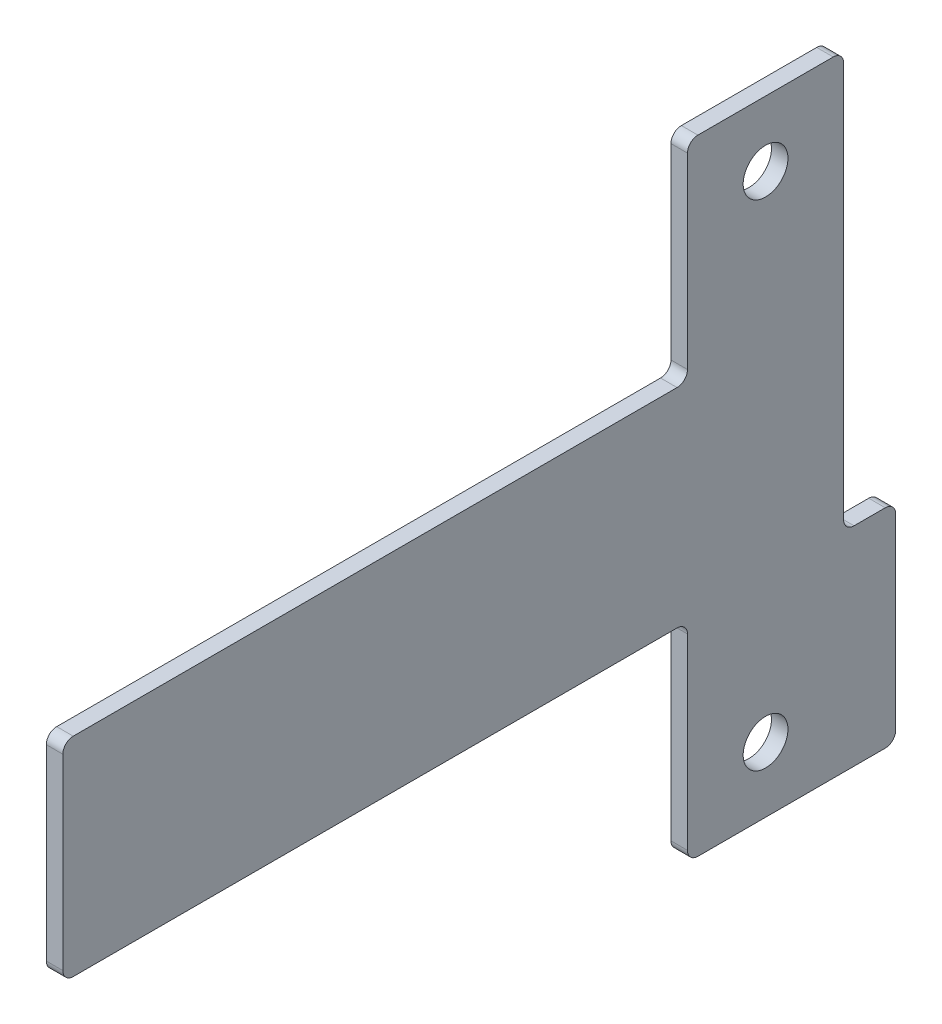
ISO-10303-21;
HEADER;
FILE_DESCRIPTION(('STEP AP214'),'2;1');
FILE_NAME('part.step','',(''),(''),'','','');
FILE_SCHEMA(('AUTOMOTIVE_DESIGN { 1 0 10303 214 1 1 1 1 }'));
ENDSEC;
DATA;
#1=APPLICATION_CONTEXT('core data for automotive mechanical design processes');
#2=APPLICATION_PROTOCOL_DEFINITION('international standard','automotive_design',2000,#1);
#3=PRODUCT_CONTEXT('',#1,'mechanical');
#4=PRODUCT('Part','Part','',(#3));
#5=PRODUCT_RELATED_PRODUCT_CATEGORY('part','',(#4));
#6=PRODUCT_DEFINITION_FORMATION('','',#4);
#7=PRODUCT_DEFINITION_CONTEXT('part definition',#1,'design');
#8=PRODUCT_DEFINITION('design','',#6,#7);
#9=PRODUCT_DEFINITION_SHAPE('','',#8);
#10=(LENGTH_UNIT() NAMED_UNIT(*) SI_UNIT(.MILLI.,.METRE.));
#11=(NAMED_UNIT(*) PLANE_ANGLE_UNIT() SI_UNIT($,.RADIAN.));
#12=(NAMED_UNIT(*) SI_UNIT($,.STERADIAN.) SOLID_ANGLE_UNIT());
#13=UNCERTAINTY_MEASURE_WITH_UNIT(LENGTH_MEASURE(1.E-05),#10,'distance_accuracy_value','');
#14=(GEOMETRIC_REPRESENTATION_CONTEXT(3) GLOBAL_UNCERTAINTY_ASSIGNED_CONTEXT((#13)) GLOBAL_UNIT_ASSIGNED_CONTEXT((#10,
#11,#12)) REPRESENTATION_CONTEXT('',''));
#15=CARTESIAN_POINT('',(0.,0.,0.));
#16=DIRECTION('',(0.,0.,1.));
#17=DIRECTION('',(1.,0.,0.));
#18=AXIS2_PLACEMENT_3D('',#15,#16,#17);
#19=CARTESIAN_POINT('',(1.5875,0.,0.));
#20=DIRECTION('',(-1.,0.,0.));
#21=DIRECTION('',(0.,0.,1.));
#22=AXIS2_PLACEMENT_3D('',#19,#20,#21);
#23=PLANE('',#22);
#24=DIRECTION('',(0.,0.,-1.));
#25=VECTOR('',#24,1.);
#26=CARTESIAN_POINT('',(1.5875,-30.,-7.50000000000001));
#27=LINE('',#26,#25);
#28=CARTESIAN_POINT('',(1.5875,-30.,6.5));
#29=VERTEX_POINT('',#28);
#30=CARTESIAN_POINT('',(1.5875,-30.,-11.5));
#31=VERTEX_POINT('',#30);
#32=EDGE_CURVE('E383',#29,#31,#27,.T.);
#33=ORIENTED_EDGE('',*,*,#32,.T.);
#34=CARTESIAN_POINT('',(1.5875,-29.,-11.5));
#35=DIRECTION('',(-1.,0.,0.));
#36=DIRECTION('',(0.,0.,1.));
#37=AXIS2_PLACEMENT_3D('',#34,#35,#36);
#38=CIRCLE('',#37,1.);
#39=CARTESIAN_POINT('',(1.5875,-29.,-12.5));
#40=VERTEX_POINT('',#39);
#41=EDGE_CURVE('E268',#31,#40,#38,.F.);
#42=ORIENTED_EDGE('',*,*,#41,.T.);
#43=DIRECTION('',(0.,1.,0.));
#44=VECTOR('',#43,1.);
#45=CARTESIAN_POINT('',(1.5875,-10.,-12.5));
#46=LINE('',#45,#44);
#47=CARTESIAN_POINT('',(1.5875,-11.,-12.5));
#48=VERTEX_POINT('',#47);
#49=EDGE_CURVE('E199',#40,#48,#46,.T.);
#50=ORIENTED_EDGE('',*,*,#49,.T.);
#51=CARTESIAN_POINT('',(1.5875,-11.,-11.5));
#52=DIRECTION('',(-1.,0.,0.));
#53=DIRECTION('',(0.,0.,1.));
#54=AXIS2_PLACEMENT_3D('',#51,#52,#53);
#55=CIRCLE('',#54,1.);
#56=CARTESIAN_POINT('',(1.5875,-10.,-11.5));
#57=VERTEX_POINT('',#56);
#58=EDGE_CURVE('E265',#48,#57,#55,.F.);
#59=ORIENTED_EDGE('',*,*,#58,.T.);
#60=DIRECTION('',(0.,0.,1.));
#61=VECTOR('',#60,1.);
#62=CARTESIAN_POINT('',(1.5875,-10.,-7.50000000000001));
#63=LINE('',#62,#61);
#64=CARTESIAN_POINT('',(1.5875,-10.,-8.5));
#65=VERTEX_POINT('',#64);
#66=EDGE_CURVE('E388',#57,#65,#63,.T.);
#67=ORIENTED_EDGE('',*,*,#66,.T.);
#68=CARTESIAN_POINT('',(1.5875,-8.99999999999999,-8.5));
#69=DIRECTION('',(-1.,0.,0.));
#70=DIRECTION('',(0.,0.,1.));
#71=AXIS2_PLACEMENT_3D('',#68,#69,#70);
#72=CIRCLE('',#71,1.);
#73=CARTESIAN_POINT('',(1.5875,-8.99999999999999,-7.50000000000001));
#74=VERTEX_POINT('',#73);
#75=EDGE_CURVE('E329',#65,#74,#72,.T.);
#76=ORIENTED_EDGE('',*,*,#75,.T.);
#77=DIRECTION('',(0.,1.,0.));
#78=VECTOR('',#77,1.);
#79=CARTESIAN_POINT('',(1.5875,30.,-7.50000000000001));
#80=LINE('',#79,#78);
#81=CARTESIAN_POINT('',(1.5875,29.,-7.50000000000001));
#82=VERTEX_POINT('',#81);
#83=EDGE_CURVE('E392',#74,#82,#80,.T.);
#84=ORIENTED_EDGE('',*,*,#83,.T.);
#85=CARTESIAN_POINT('',(1.5875,29.,-6.5));
#86=DIRECTION('',(-1.,0.,0.));
#87=DIRECTION('',(0.,0.,1.));
#88=AXIS2_PLACEMENT_3D('',#85,#86,#87);
#89=CIRCLE('',#88,1.);
#90=CARTESIAN_POINT('',(1.5875,30.,-6.5));
#91=VERTEX_POINT('',#90);
#92=EDGE_CURVE('E62',#82,#91,#89,.F.);
#93=ORIENTED_EDGE('',*,*,#92,.T.);
#94=DIRECTION('',(0.,0.,1.));
#95=VECTOR('',#94,1.);
#96=CARTESIAN_POINT('',(1.5875,30.,7.5));
#97=LINE('',#96,#95);
#98=CARTESIAN_POINT('',(1.5875,30.,6.5));
#99=VERTEX_POINT('',#98);
#100=EDGE_CURVE('E228',#91,#99,#97,.T.);
#101=ORIENTED_EDGE('',*,*,#100,.T.);
#102=CARTESIAN_POINT('',(1.5875,29.,6.5));
#103=DIRECTION('',(-1.,0.,0.));
#104=DIRECTION('',(0.,0.,1.));
#105=AXIS2_PLACEMENT_3D('',#102,#103,#104);
#106=CIRCLE('',#105,1.);
#107=CARTESIAN_POINT('',(1.5875,29.,7.5));
#108=VERTEX_POINT('',#107);
#109=EDGE_CURVE('E251',#99,#108,#106,.F.);
#110=ORIENTED_EDGE('',*,*,#109,.T.);
#111=DIRECTION('',(0.,-1.,0.));
#112=VECTOR('',#111,1.);
#113=CARTESIAN_POINT('',(1.5875,10.,7.5));
#114=LINE('',#113,#112);
#115=CARTESIAN_POINT('',(1.5875,11.,7.5));
#116=VERTEX_POINT('',#115);
#117=EDGE_CURVE('E226',#108,#116,#114,.T.);
#118=ORIENTED_EDGE('',*,*,#117,.T.);
#119=CARTESIAN_POINT('',(1.5875,11.,8.5));
#120=DIRECTION('',(-1.,0.,0.));
#121=DIRECTION('',(0.,0.,1.));
#122=AXIS2_PLACEMENT_3D('',#119,#120,#121);
#123=CIRCLE('',#122,1.);
#124=CARTESIAN_POINT('',(1.5875,10.,8.5));
#125=VERTEX_POINT('',#124);
#126=EDGE_CURVE('E11',#116,#125,#123,.T.);
#127=ORIENTED_EDGE('',*,*,#126,.T.);
#128=DIRECTION('',(0.,0.,1.));
#129=VECTOR('',#128,1.);
#130=CARTESIAN_POINT('',(1.5875,10.,67.5));
#131=LINE('',#130,#129);
#132=CARTESIAN_POINT('',(1.5875,10.,66.5));
#133=VERTEX_POINT('',#132);
#134=EDGE_CURVE('E360',#125,#133,#131,.T.);
#135=ORIENTED_EDGE('',*,*,#134,.T.);
#136=CARTESIAN_POINT('',(1.5875,9.00000000000001,66.5));
#137=DIRECTION('',(-1.,0.,0.));
#138=DIRECTION('',(0.,0.,1.));
#139=AXIS2_PLACEMENT_3D('',#136,#137,#138);
#140=CIRCLE('',#139,1.);
#141=CARTESIAN_POINT('',(1.5875,9.00000000000001,67.5));
#142=VERTEX_POINT('',#141);
#143=EDGE_CURVE('E257',#133,#142,#140,.F.);
#144=ORIENTED_EDGE('',*,*,#143,.T.);
#145=DIRECTION('',(0.,-1.,0.));
#146=VECTOR('',#145,1.);
#147=CARTESIAN_POINT('',(1.5875,-10.,67.5));
#148=LINE('',#147,#146);
#149=CARTESIAN_POINT('',(1.5875,-9.00000000000001,67.5));
#150=VERTEX_POINT('',#149);
#151=EDGE_CURVE('E366',#142,#150,#148,.T.);
#152=ORIENTED_EDGE('',*,*,#151,.T.);
#153=CARTESIAN_POINT('',(1.5875,-9.00000000000001,66.5));
#154=DIRECTION('',(-1.,0.,0.));
#155=DIRECTION('',(0.,0.,1.));
#156=AXIS2_PLACEMENT_3D('',#153,#154,#155);
#157=CIRCLE('',#156,1.);
#158=CARTESIAN_POINT('',(1.5875,-10.,66.5));
#159=VERTEX_POINT('',#158);
#160=EDGE_CURVE('E260',#150,#159,#157,.F.);
#161=ORIENTED_EDGE('',*,*,#160,.T.);
#162=DIRECTION('',(0.,0.,-1.));
#163=VECTOR('',#162,1.);
#164=CARTESIAN_POINT('',(1.5875,-10.,7.5));
#165=LINE('',#164,#163);
#166=CARTESIAN_POINT('',(1.5875,-10.,8.5));
#167=VERTEX_POINT('',#166);
#168=EDGE_CURVE('E371',#159,#167,#165,.T.);
#169=ORIENTED_EDGE('',*,*,#168,.T.);
#170=CARTESIAN_POINT('',(1.5875,-11.,8.5));
#171=DIRECTION('',(-1.,0.,0.));
#172=DIRECTION('',(0.,0.,1.));
#173=AXIS2_PLACEMENT_3D('',#170,#171,#172);
#174=CIRCLE('',#173,1.);
#175=CARTESIAN_POINT('',(1.5875,-11.,7.5));
#176=VERTEX_POINT('',#175);
#177=EDGE_CURVE('E335',#167,#176,#174,.T.);
#178=ORIENTED_EDGE('',*,*,#177,.T.);
#179=DIRECTION('',(0.,-1.,0.));
#180=VECTOR('',#179,1.);
#181=CARTESIAN_POINT('',(1.5875,-30.,7.5));
#182=LINE('',#181,#180);
#183=CARTESIAN_POINT('',(1.5875,-29.,7.5));
#184=VERTEX_POINT('',#183);
#185=EDGE_CURVE('E379',#176,#184,#182,.T.);
#186=ORIENTED_EDGE('',*,*,#185,.T.);
#187=CARTESIAN_POINT('',(1.5875,-29.,6.5));
#188=DIRECTION('',(-1.,0.,0.));
#189=DIRECTION('',(0.,0.,1.));
#190=AXIS2_PLACEMENT_3D('',#187,#188,#189);
#191=CIRCLE('',#190,1.);
#192=EDGE_CURVE('E254',#184,#29,#191,.F.);
#193=ORIENTED_EDGE('',*,*,#192,.T.);
#194=EDGE_LOOP('',(#33,#42,#50,#59,#67,#76,#84,#93,#101,#110,#118,#127,#135,#144,#152,#161,#169,
#178,#186,#193));
#195=FACE_BOUND('',#194,.T.);
#196=CARTESIAN_POINT('',(1.5875,23.75,0.));
#197=DIRECTION('',(1.,0.,0.));
#198=DIRECTION('',(0.,0.,-1.));
#199=AXIS2_PLACEMENT_3D('',#196,#197,#198);
#200=CIRCLE('',#199,2.15);
#201=CARTESIAN_POINT('',(1.5875,23.75,-2.14999999999999));
#202=VERTEX_POINT('',#201);
#203=EDGE_CURVE('E353',#202,#202,#200,.T.);
#204=ORIENTED_EDGE('',*,*,#203,.F.);
#205=EDGE_LOOP('',(#204));
#206=FACE_BOUND('',#205,.T.);
#207=CARTESIAN_POINT('',(1.5875,-23.75,0.));
#208=DIRECTION('',(1.,0.,0.));
#209=DIRECTION('',(0.,0.,-1.));
#210=AXIS2_PLACEMENT_3D('',#207,#208,#209);
#211=CIRCLE('',#210,2.15);
#212=CARTESIAN_POINT('',(1.5875,-23.75,-2.15));
#213=VERTEX_POINT('',#212);
#214=EDGE_CURVE('E659',#213,#213,#211,.T.);
#215=ORIENTED_EDGE('',*,*,#214,.F.);
#216=EDGE_LOOP('',(#215));
#217=FACE_BOUND('',#216,.T.);
#218=ADVANCED_FACE('F39',(#195,#206,#217),#23,.F.);
#219=CARTESIAN_POINT('',(0.,0.,0.));
#220=DIRECTION('',(-1.,0.,0.));
#221=DIRECTION('',(0.,0.,1.));
#222=AXIS2_PLACEMENT_3D('',#219,#220,#221);
#223=PLANE('',#222);
#224=CARTESIAN_POINT('',(0.,23.75,0.));
#225=DIRECTION('',(1.,0.,0.));
#226=DIRECTION('',(0.,0.,-1.));
#227=AXIS2_PLACEMENT_3D('',#224,#225,#226);
#228=CIRCLE('',#227,2.15);
#229=CARTESIAN_POINT('',(0.,23.75,-2.14999999999999));
#230=VERTEX_POINT('',#229);
#231=EDGE_CURVE('E657',#230,#230,#228,.T.);
#232=ORIENTED_EDGE('',*,*,#231,.T.);
#233=EDGE_LOOP('',(#232));
#234=FACE_BOUND('',#233,.T.);
#235=DIRECTION('',(0.,1.,0.));
#236=VECTOR('',#235,1.);
#237=CARTESIAN_POINT('',(0.,-10.,-12.5));
#238=LINE('',#237,#236);
#239=CARTESIAN_POINT('',(0.,-29.,-12.5));
#240=VERTEX_POINT('',#239);
#241=CARTESIAN_POINT('',(0.,-11.,-12.5));
#242=VERTEX_POINT('',#241);
#243=EDGE_CURVE('E196',#240,#242,#238,.T.);
#244=ORIENTED_EDGE('',*,*,#243,.F.);
#245=CARTESIAN_POINT('',(0.,-29.,-11.5));
#246=DIRECTION('',(-1.,0.,0.));
#247=DIRECTION('',(0.,0.,1.));
#248=AXIS2_PLACEMENT_3D('',#245,#246,#247);
#249=CIRCLE('',#248,1.);
#250=CARTESIAN_POINT('',(0.,-30.,-11.5));
#251=VERTEX_POINT('',#250);
#252=EDGE_CURVE('E178',#240,#251,#249,.T.);
#253=ORIENTED_EDGE('',*,*,#252,.T.);
#254=DIRECTION('',(0.,0.,-1.));
#255=VECTOR('',#254,1.);
#256=CARTESIAN_POINT('',(0.,-30.,-12.5));
#257=LINE('',#256,#255);
#258=CARTESIAN_POINT('',(0.,-30.,6.5));
#259=VERTEX_POINT('',#258);
#260=EDGE_CURVE('E209',#259,#251,#257,.T.);
#261=ORIENTED_EDGE('',*,*,#260,.F.);
#262=CARTESIAN_POINT('',(0.,-29.,6.5));
#263=DIRECTION('',(-1.,0.,0.));
#264=DIRECTION('',(0.,0.,1.));
#265=AXIS2_PLACEMENT_3D('',#262,#263,#264);
#266=CIRCLE('',#265,1.);
#267=CARTESIAN_POINT('',(0.,-29.,7.5));
#268=VERTEX_POINT('',#267);
#269=EDGE_CURVE('E232',#259,#268,#266,.T.);
#270=ORIENTED_EDGE('',*,*,#269,.T.);
#271=DIRECTION('',(0.,-1.,0.));
#272=VECTOR('',#271,1.);
#273=CARTESIAN_POINT('',(0.,-30.,7.5));
#274=LINE('',#273,#272);
#275=CARTESIAN_POINT('',(0.,-11.,7.5));
#276=VERTEX_POINT('',#275);
#277=EDGE_CURVE('E216',#276,#268,#274,.T.);
#278=ORIENTED_EDGE('',*,*,#277,.F.);
#279=CARTESIAN_POINT('',(0.,-11.,8.5));
#280=DIRECTION('',(-1.,0.,0.));
#281=DIRECTION('',(0.,0.,1.));
#282=AXIS2_PLACEMENT_3D('',#279,#280,#281);
#283=CIRCLE('',#282,1.);
#284=CARTESIAN_POINT('',(0.,-10.,8.5));
#285=VERTEX_POINT('',#284);
#286=EDGE_CURVE('E332',#276,#285,#283,.F.);
#287=ORIENTED_EDGE('',*,*,#286,.T.);
#288=DIRECTION('',(0.,0.,-1.));
#289=VECTOR('',#288,1.);
#290=CARTESIAN_POINT('',(0.,-10.,7.5));
#291=LINE('',#290,#289);
#292=CARTESIAN_POINT('',(0.,-10.,66.5));
#293=VERTEX_POINT('',#292);
#294=EDGE_CURVE('E403',#293,#285,#291,.T.);
#295=ORIENTED_EDGE('',*,*,#294,.F.);
#296=CARTESIAN_POINT('',(0.,-9.00000000000001,66.5));
#297=DIRECTION('',(-1.,0.,0.));
#298=DIRECTION('',(0.,0.,1.));
#299=AXIS2_PLACEMENT_3D('',#296,#297,#298);
#300=CIRCLE('',#299,1.);
#301=CARTESIAN_POINT('',(0.,-9.00000000000001,67.5));
#302=VERTEX_POINT('',#301);
#303=EDGE_CURVE('E238',#293,#302,#300,.T.);
#304=ORIENTED_EDGE('',*,*,#303,.T.);
#305=DIRECTION('',(0.,-1.,0.));
#306=VECTOR('',#305,1.);
#307=CARTESIAN_POINT('',(0.,-10.,67.5));
#308=LINE('',#307,#306);
#309=CARTESIAN_POINT('',(0.,9.00000000000001,67.5));
#310=VERTEX_POINT('',#309);
#311=EDGE_CURVE('E399',#310,#302,#308,.T.);
#312=ORIENTED_EDGE('',*,*,#311,.F.);
#313=CARTESIAN_POINT('',(0.,9.00000000000001,66.5));
#314=DIRECTION('',(-1.,0.,0.));
#315=DIRECTION('',(0.,0.,1.));
#316=AXIS2_PLACEMENT_3D('',#313,#314,#315);
#317=CIRCLE('',#316,1.);
#318=CARTESIAN_POINT('',(0.,10.,66.5));
#319=VERTEX_POINT('',#318);
#320=EDGE_CURVE('E235',#310,#319,#317,.T.);
#321=ORIENTED_EDGE('',*,*,#320,.T.);
#322=DIRECTION('',(0.,0.,1.));
#323=VECTOR('',#322,1.);
#324=CARTESIAN_POINT('',(0.,10.,67.5));
#325=LINE('',#324,#323);
#326=CARTESIAN_POINT('',(0.,10.,8.5));
#327=VERTEX_POINT('',#326);
#328=EDGE_CURVE('E343',#327,#319,#325,.T.);
#329=ORIENTED_EDGE('',*,*,#328,.F.);
#330=CARTESIAN_POINT('',(0.,11.,8.5));
#331=DIRECTION('',(-1.,0.,0.));
#332=DIRECTION('',(0.,0.,1.));
#333=AXIS2_PLACEMENT_3D('',#330,#331,#332);
#334=CIRCLE('',#333,1.);
#335=CARTESIAN_POINT('',(0.,11.,7.5));
#336=VERTEX_POINT('',#335);
#337=EDGE_CURVE('E48',#327,#336,#334,.F.);
#338=ORIENTED_EDGE('',*,*,#337,.T.);
#339=DIRECTION('',(0.,-1.,0.));
#340=VECTOR('',#339,1.);
#341=CARTESIAN_POINT('',(0.,10.,7.5));
#342=LINE('',#341,#340);
#343=CARTESIAN_POINT('',(0.,29.,7.5));
#344=VERTEX_POINT('',#343);
#345=EDGE_CURVE('E341',#344,#336,#342,.T.);
#346=ORIENTED_EDGE('',*,*,#345,.F.);
#347=CARTESIAN_POINT('',(0.,29.,6.5));
#348=DIRECTION('',(-1.,0.,0.));
#349=DIRECTION('',(0.,0.,1.));
#350=AXIS2_PLACEMENT_3D('',#347,#348,#349);
#351=CIRCLE('',#350,1.);
#352=CARTESIAN_POINT('',(0.,30.,6.5));
#353=VERTEX_POINT('',#352);
#354=EDGE_CURVE('E201',#344,#353,#351,.T.);
#355=ORIENTED_EDGE('',*,*,#354,.T.);
#356=DIRECTION('',(0.,0.,1.));
#357=VECTOR('',#356,1.);
#358=CARTESIAN_POINT('',(0.,30.,7.5));
#359=LINE('',#358,#357);
#360=CARTESIAN_POINT('',(0.,30.,-6.5));
#361=VERTEX_POINT('',#360);
#362=EDGE_CURVE('E223',#361,#353,#359,.T.);
#363=ORIENTED_EDGE('',*,*,#362,.F.);
#364=CARTESIAN_POINT('',(0.,29.,-6.5));
#365=DIRECTION('',(-1.,0.,0.));
#366=DIRECTION('',(0.,0.,1.));
#367=AXIS2_PLACEMENT_3D('',#364,#365,#366);
#368=CIRCLE('',#367,1.);
#369=CARTESIAN_POINT('',(0.,29.,-7.50000000000001));
#370=VERTEX_POINT('',#369);
#371=EDGE_CURVE('E241',#361,#370,#368,.T.);
#372=ORIENTED_EDGE('',*,*,#371,.T.);
#373=DIRECTION('',(0.,1.,0.));
#374=VECTOR('',#373,1.);
#375=CARTESIAN_POINT('',(0.,30.,-7.50000000000001));
#376=LINE('',#375,#374);
#377=CARTESIAN_POINT('',(0.,-8.99999999999999,-7.50000000000001));
#378=VERTEX_POINT('',#377);
#379=EDGE_CURVE('E214',#378,#370,#376,.T.);
#380=ORIENTED_EDGE('',*,*,#379,.F.);
#381=CARTESIAN_POINT('',(0.,-8.99999999999999,-8.5));
#382=DIRECTION('',(-1.,0.,0.));
#383=DIRECTION('',(0.,0.,1.));
#384=AXIS2_PLACEMENT_3D('',#381,#382,#383);
#385=CIRCLE('',#384,1.);
#386=CARTESIAN_POINT('',(0.,-10.,-8.5));
#387=VERTEX_POINT('',#386);
#388=EDGE_CURVE('E326',#378,#387,#385,.F.);
#389=ORIENTED_EDGE('',*,*,#388,.T.);
#390=DIRECTION('',(0.,0.,1.));
#391=VECTOR('',#390,1.);
#392=CARTESIAN_POINT('',(0.,-10.,-7.50000000000001));
#393=LINE('',#392,#391);
#394=CARTESIAN_POINT('',(0.,-10.,-11.5));
#395=VERTEX_POINT('',#394);
#396=EDGE_CURVE('E208',#395,#387,#393,.T.);
#397=ORIENTED_EDGE('',*,*,#396,.F.);
#398=CARTESIAN_POINT('',(0.,-11.,-11.5));
#399=DIRECTION('',(-1.,0.,0.));
#400=DIRECTION('',(0.,0.,1.));
#401=AXIS2_PLACEMENT_3D('',#398,#399,#400);
#402=CIRCLE('',#401,1.);
#403=EDGE_CURVE('E190',#395,#242,#402,.T.);
#404=ORIENTED_EDGE('',*,*,#403,.T.);
#405=EDGE_LOOP('',(#244,#253,#261,#270,#278,#287,#295,#304,#312,#321,#329,#338,#346,#355,#363,
#372,#380,#389,#397,#404));
#406=FACE_BOUND('',#405,.T.);
#407=CARTESIAN_POINT('',(0.,-23.75,0.));
#408=DIRECTION('',(1.,0.,0.));
#409=DIRECTION('',(0.,0.,-1.));
#410=AXIS2_PLACEMENT_3D('',#407,#408,#409);
#411=CIRCLE('',#410,2.15);
#412=CARTESIAN_POINT('',(0.,-23.75,-2.15));
#413=VERTEX_POINT('',#412);
#414=EDGE_CURVE('E664',#413,#413,#411,.T.);
#415=ORIENTED_EDGE('',*,*,#414,.T.);
#416=EDGE_LOOP('',(#415));
#417=FACE_BOUND('',#416,.T.);
#418=ADVANCED_FACE('F204',(#234,#406,#417),#223,.T.);
#419=CARTESIAN_POINT('',(1.5875,10.,7.5));
#420=DIRECTION('',(0.,0.,-1.));
#421=DIRECTION('',(0.,1.,0.));
#422=AXIS2_PLACEMENT_3D('',#419,#420,#421);
#423=PLANE('',#422);
#424=ORIENTED_EDGE('',*,*,#117,.F.);
#425=DIRECTION('',(-1.,0.,0.));
#426=VECTOR('',#425,1.);
#427=CARTESIAN_POINT('',(1.5875,29.,7.5));
#428=LINE('',#427,#426);
#429=EDGE_CURVE('E322',#108,#344,#428,.T.);
#430=ORIENTED_EDGE('',*,*,#429,.T.);
#431=ORIENTED_EDGE('',*,*,#345,.T.);
#432=DIRECTION('',(-1.,0.,0.));
#433=VECTOR('',#432,1.);
#434=CARTESIAN_POINT('',(1.5875,11.,7.5));
#435=LINE('',#434,#433);
#436=EDGE_CURVE('E319',#336,#116,#435,.F.);
#437=ORIENTED_EDGE('',*,*,#436,.T.);
#438=EDGE_LOOP('',(#424,#430,#431,#437));
#439=FACE_BOUND('',#438,.T.);
#440=ADVANCED_FACE('F349',(#439),#423,.F.);
#441=CARTESIAN_POINT('',(1.5875,10.,67.5));
#442=DIRECTION('',(0.,-1.,0.));
#443=DIRECTION('',(0.,0.,-1.));
#444=AXIS2_PLACEMENT_3D('',#441,#442,#443);
#445=PLANE('',#444);
#446=ORIENTED_EDGE('',*,*,#328,.T.);
#447=DIRECTION('',(-1.,0.,0.));
#448=VECTOR('',#447,1.);
#449=CARTESIAN_POINT('',(1.5875,10.,66.5));
#450=LINE('',#449,#448);
#451=EDGE_CURVE('E309',#319,#133,#450,.F.);
#452=ORIENTED_EDGE('',*,*,#451,.T.);
#453=ORIENTED_EDGE('',*,*,#134,.F.);
#454=DIRECTION('',(-1.,0.,0.));
#455=VECTOR('',#454,1.);
#456=CARTESIAN_POINT('',(0.,10.,8.5));
#457=LINE('',#456,#455);
#458=EDGE_CURVE('E305',#125,#327,#457,.T.);
#459=ORIENTED_EDGE('',*,*,#458,.T.);
#460=EDGE_LOOP('',(#446,#452,#453,#459));
#461=FACE_BOUND('',#460,.T.);
#462=ADVANCED_FACE('F363',(#461),#445,.F.);
#463=CARTESIAN_POINT('',(1.5875,-10.,67.5));
#464=DIRECTION('',(0.,0.,-1.));
#465=DIRECTION('',(-1.,0.,0.));
#466=AXIS2_PLACEMENT_3D('',#463,#464,#465);
#467=PLANE('',#466);
#468=ORIENTED_EDGE('',*,*,#311,.T.);
#469=DIRECTION('',(-1.,0.,0.));
#470=VECTOR('',#469,1.);
#471=CARTESIAN_POINT('',(1.5875,-9.00000000000001,67.5));
#472=LINE('',#471,#470);
#473=EDGE_CURVE('E302',#302,#150,#472,.F.);
#474=ORIENTED_EDGE('',*,*,#473,.T.);
#475=ORIENTED_EDGE('',*,*,#151,.F.);
#476=DIRECTION('',(-1.,0.,0.));
#477=VECTOR('',#476,1.);
#478=CARTESIAN_POINT('',(1.5875,9.00000000000001,67.5));
#479=LINE('',#478,#477);
#480=EDGE_CURVE('E298',#142,#310,#479,.T.);
#481=ORIENTED_EDGE('',*,*,#480,.T.);
#482=EDGE_LOOP('',(#468,#474,#475,#481));
#483=FACE_BOUND('',#482,.T.);
#484=ADVANCED_FACE('F601',(#483),#467,.F.);
#485=CARTESIAN_POINT('',(1.5875,-10.,7.5));
#486=DIRECTION('',(0.,1.,0.));
#487=DIRECTION('',(0.,0.,1.));
#488=AXIS2_PLACEMENT_3D('',#485,#486,#487);
#489=PLANE('',#488);
#490=ORIENTED_EDGE('',*,*,#168,.F.);
#491=DIRECTION('',(-1.,0.,0.));
#492=VECTOR('',#491,1.);
#493=CARTESIAN_POINT('',(1.5875,-10.,66.5));
#494=LINE('',#493,#492);
#495=EDGE_CURVE('E294',#159,#293,#494,.T.);
#496=ORIENTED_EDGE('',*,*,#495,.T.);
#497=ORIENTED_EDGE('',*,*,#294,.T.);
#498=DIRECTION('',(-1.,0.,0.));
#499=VECTOR('',#498,1.);
#500=CARTESIAN_POINT('',(1.5875,-10.,8.5));
#501=LINE('',#500,#499);
#502=EDGE_CURVE('E291',#285,#167,#501,.F.);
#503=ORIENTED_EDGE('',*,*,#502,.T.);
#504=EDGE_LOOP('',(#490,#496,#497,#503));
#505=FACE_BOUND('',#504,.T.);
#506=ADVANCED_FACE('F429',(#505),#489,.F.);
#507=CARTESIAN_POINT('',(1.5875,-30.,7.5));
#508=DIRECTION('',(0.,0.,-1.));
#509=DIRECTION('',(0.,1.,0.));
#510=AXIS2_PLACEMENT_3D('',#507,#508,#509);
#511=PLANE('',#510);
#512=ORIENTED_EDGE('',*,*,#185,.F.);
#513=DIRECTION('',(-1.,0.,0.));
#514=VECTOR('',#513,1.);
#515=CARTESIAN_POINT('',(0.,-11.,7.5));
#516=LINE('',#515,#514);
#517=EDGE_CURVE('E315',#176,#276,#516,.T.);
#518=ORIENTED_EDGE('',*,*,#517,.T.);
#519=ORIENTED_EDGE('',*,*,#277,.T.);
#520=DIRECTION('',(-1.,0.,0.));
#521=VECTOR('',#520,1.);
#522=CARTESIAN_POINT('',(1.5875,-29.,7.5));
#523=LINE('',#522,#521);
#524=EDGE_CURVE('E312',#268,#184,#523,.F.);
#525=ORIENTED_EDGE('',*,*,#524,.T.);
#526=EDGE_LOOP('',(#512,#518,#519,#525));
#527=FACE_BOUND('',#526,.T.);
#528=ADVANCED_FACE('F412',(#527),#511,.F.);
#529=CARTESIAN_POINT('',(1.5875,-30.,-12.5));
#530=DIRECTION('',(0.,1.,0.));
#531=DIRECTION('',(0.,0.,1.));
#532=AXIS2_PLACEMENT_3D('',#529,#530,#531);
#533=PLANE('',#532);
#534=ORIENTED_EDGE('',*,*,#260,.T.);
#535=DIRECTION('',(-1.,0.,0.));
#536=VECTOR('',#535,1.);
#537=CARTESIAN_POINT('',(1.5875,-30.,-11.5));
#538=LINE('',#537,#536);
#539=EDGE_CURVE('E183',#251,#31,#538,.F.);
#540=ORIENTED_EDGE('',*,*,#539,.T.);
#541=ORIENTED_EDGE('',*,*,#32,.F.);
#542=DIRECTION('',(-1.,0.,0.));
#543=VECTOR('',#542,1.);
#544=CARTESIAN_POINT('',(1.5875,-30.,6.5));
#545=LINE('',#544,#543);
#546=EDGE_CURVE('E189',#29,#259,#545,.T.);
#547=ORIENTED_EDGE('',*,*,#546,.T.);
#548=EDGE_LOOP('',(#534,#540,#541,#547));
#549=FACE_BOUND('',#548,.T.);
#550=ADVANCED_FACE('F420',(#549),#533,.F.);
#551=CARTESIAN_POINT('',(1.5875,-10.,-12.5));
#552=DIRECTION('',(0.,0.,1.));
#553=DIRECTION('',(0.,-1.,0.));
#554=AXIS2_PLACEMENT_3D('',#551,#552,#553);
#555=PLANE('',#554);
#556=ORIENTED_EDGE('',*,*,#49,.F.);
#557=DIRECTION('',(-1.,0.,0.));
#558=VECTOR('',#557,1.);
#559=CARTESIAN_POINT('',(1.5875,-29.,-12.5));
#560=LINE('',#559,#558);
#561=EDGE_CURVE('E182',#40,#240,#560,.T.);
#562=ORIENTED_EDGE('',*,*,#561,.T.);
#563=ORIENTED_EDGE('',*,*,#243,.T.);
#564=DIRECTION('',(-1.,0.,0.));
#565=VECTOR('',#564,1.);
#566=CARTESIAN_POINT('',(1.5875,-11.,-12.5));
#567=LINE('',#566,#565);
#568=EDGE_CURVE('E202',#242,#48,#567,.F.);
#569=ORIENTED_EDGE('',*,*,#568,.T.);
#570=EDGE_LOOP('',(#556,#562,#563,#569));
#571=FACE_BOUND('',#570,.T.);
#572=ADVANCED_FACE('F195',(#571),#555,.F.);
#573=CARTESIAN_POINT('',(1.5875,-10.,-7.50000000000001));
#574=DIRECTION('',(0.,-1.,0.));
#575=DIRECTION('',(0.,0.,-1.));
#576=AXIS2_PLACEMENT_3D('',#573,#574,#575);
#577=PLANE('',#576);
#578=ORIENTED_EDGE('',*,*,#66,.F.);
#579=DIRECTION('',(-1.,0.,0.));
#580=VECTOR('',#579,1.);
#581=CARTESIAN_POINT('',(1.5875,-10.,-11.5));
#582=LINE('',#581,#580);
#583=EDGE_CURVE('E274',#57,#395,#582,.T.);
#584=ORIENTED_EDGE('',*,*,#583,.T.);
#585=ORIENTED_EDGE('',*,*,#396,.T.);
#586=DIRECTION('',(-1.,0.,0.));
#587=VECTOR('',#586,1.);
#588=CARTESIAN_POINT('',(1.5875,-10.,-8.5));
#589=LINE('',#588,#587);
#590=EDGE_CURVE('E271',#387,#65,#589,.F.);
#591=ORIENTED_EDGE('',*,*,#590,.T.);
#592=EDGE_LOOP('',(#578,#584,#585,#591));
#593=FACE_BOUND('',#592,.T.);
#594=ADVANCED_FACE('F427',(#593),#577,.F.);
#595=CARTESIAN_POINT('',(1.5875,30.,-7.50000000000001));
#596=DIRECTION('',(0.,0.,1.));
#597=DIRECTION('',(1.,0.,0.));
#598=AXIS2_PLACEMENT_3D('',#595,#596,#597);
#599=PLANE('',#598);
#600=ORIENTED_EDGE('',*,*,#83,.F.);
#601=DIRECTION('',(-1.,0.,0.));
#602=VECTOR('',#601,1.);
#603=CARTESIAN_POINT('',(0.,-8.99999999999999,-7.50000000000001));
#604=LINE('',#603,#602);
#605=EDGE_CURVE('E281',#74,#378,#604,.T.);
#606=ORIENTED_EDGE('',*,*,#605,.T.);
#607=ORIENTED_EDGE('',*,*,#379,.T.);
#608=DIRECTION('',(-1.,0.,0.));
#609=VECTOR('',#608,1.);
#610=CARTESIAN_POINT('',(1.5875,29.,-7.50000000000001));
#611=LINE('',#610,#609);
#612=EDGE_CURVE('E278',#370,#82,#611,.F.);
#613=ORIENTED_EDGE('',*,*,#612,.T.);
#614=EDGE_LOOP('',(#600,#606,#607,#613));
#615=FACE_BOUND('',#614,.T.);
#616=ADVANCED_FACE('F445',(#615),#599,.F.);
#617=CARTESIAN_POINT('',(1.5875,30.,7.5));
#618=DIRECTION('',(0.,-1.,0.));
#619=DIRECTION('',(0.,0.,-1.));
#620=AXIS2_PLACEMENT_3D('',#617,#618,#619);
#621=PLANE('',#620);
#622=ORIENTED_EDGE('',*,*,#100,.F.);
#623=DIRECTION('',(-1.,0.,0.));
#624=VECTOR('',#623,1.);
#625=CARTESIAN_POINT('',(1.5875,30.,-6.5));
#626=LINE('',#625,#624);
#627=EDGE_CURVE('E287',#91,#361,#626,.T.);
#628=ORIENTED_EDGE('',*,*,#627,.T.);
#629=ORIENTED_EDGE('',*,*,#362,.T.);
#630=DIRECTION('',(-1.,0.,0.));
#631=VECTOR('',#630,1.);
#632=CARTESIAN_POINT('',(1.5875,30.,6.5));
#633=LINE('',#632,#631);
#634=EDGE_CURVE('E55',#353,#99,#633,.F.);
#635=ORIENTED_EDGE('',*,*,#634,.T.);
#636=EDGE_LOOP('',(#622,#628,#629,#635));
#637=FACE_BOUND('',#636,.T.);
#638=ADVANCED_FACE('F442',(#637),#621,.F.);
#639=CARTESIAN_POINT('',(1.5875,23.75,0.));
#640=DIRECTION('',(-1.,0.,0.));
#641=DIRECTION('',(0.,0.,1.));
#642=AXIS2_PLACEMENT_3D('',#639,#640,#641);
#643=CYLINDRICAL_SURFACE('',#642,2.15);
#644=ORIENTED_EDGE('',*,*,#203,.T.);
#645=EDGE_LOOP('',(#644));
#646=FACE_BOUND('',#645,.T.);
#647=ORIENTED_EDGE('',*,*,#231,.F.);
#648=EDGE_LOOP('',(#647));
#649=FACE_BOUND('',#648,.T.);
#650=ADVANCED_FACE('F439',(#646,#649),#643,.F.);
#651=CARTESIAN_POINT('',(1.5875,-23.75,0.));
#652=DIRECTION('',(-1.,0.,0.));
#653=DIRECTION('',(0.,0.,1.));
#654=AXIS2_PLACEMENT_3D('',#651,#652,#653);
#655=CYLINDRICAL_SURFACE('',#654,2.15);
#656=ORIENTED_EDGE('',*,*,#214,.T.);
#657=EDGE_LOOP('',(#656));
#658=FACE_BOUND('',#657,.T.);
#659=ORIENTED_EDGE('',*,*,#414,.F.);
#660=EDGE_LOOP('',(#659));
#661=FACE_BOUND('',#660,.T.);
#662=ADVANCED_FACE('F470',(#658,#661),#655,.F.);
#663=CARTESIAN_POINT('',(1.5875,-29.,-11.5));
#664=DIRECTION('',(-1.,0.,0.));
#665=DIRECTION('',(0.,0.,1.));
#666=AXIS2_PLACEMENT_3D('',#663,#664,#665);
#667=CYLINDRICAL_SURFACE('',#666,1.);
#668=ORIENTED_EDGE('',*,*,#41,.F.);
#669=ORIENTED_EDGE('',*,*,#539,.F.);
#670=ORIENTED_EDGE('',*,*,#252,.F.);
#671=ORIENTED_EDGE('',*,*,#561,.F.);
#672=EDGE_LOOP('',(#668,#669,#670,#671));
#673=FACE_BOUND('',#672,.T.);
#674=ADVANCED_FACE('F181',(#673),#667,.T.);
#675=CARTESIAN_POINT('',(1.5875,-11.,-11.5));
#676=DIRECTION('',(-1.,0.,0.));
#677=DIRECTION('',(0.,0.,1.));
#678=AXIS2_PLACEMENT_3D('',#675,#676,#677);
#679=CYLINDRICAL_SURFACE('',#678,1.);
#680=ORIENTED_EDGE('',*,*,#58,.F.);
#681=ORIENTED_EDGE('',*,*,#568,.F.);
#682=ORIENTED_EDGE('',*,*,#403,.F.);
#683=ORIENTED_EDGE('',*,*,#583,.F.);
#684=EDGE_LOOP('',(#680,#681,#682,#683));
#685=FACE_BOUND('',#684,.T.);
#686=ADVANCED_FACE('F459',(#685),#679,.T.);
#687=CARTESIAN_POINT('',(1.5875,-8.99999999999999,-8.5));
#688=DIRECTION('',(1.,0.,0.));
#689=DIRECTION('',(0.,0.,-1.));
#690=AXIS2_PLACEMENT_3D('',#687,#688,#689);
#691=CYLINDRICAL_SURFACE('',#690,1.);
#692=ORIENTED_EDGE('',*,*,#75,.F.);
#693=ORIENTED_EDGE('',*,*,#590,.F.);
#694=ORIENTED_EDGE('',*,*,#388,.F.);
#695=ORIENTED_EDGE('',*,*,#605,.F.);
#696=EDGE_LOOP('',(#692,#693,#694,#695));
#697=FACE_BOUND('',#696,.T.);
#698=ADVANCED_FACE('F461',(#697),#691,.F.);
#699=CARTESIAN_POINT('',(1.5875,29.,-6.5));
#700=DIRECTION('',(-1.,0.,0.));
#701=DIRECTION('',(0.,0.,1.));
#702=AXIS2_PLACEMENT_3D('',#699,#700,#701);
#703=CYLINDRICAL_SURFACE('',#702,1.);
#704=ORIENTED_EDGE('',*,*,#92,.F.);
#705=ORIENTED_EDGE('',*,*,#612,.F.);
#706=ORIENTED_EDGE('',*,*,#371,.F.);
#707=ORIENTED_EDGE('',*,*,#627,.F.);
#708=EDGE_LOOP('',(#704,#705,#706,#707));
#709=FACE_BOUND('',#708,.T.);
#710=ADVANCED_FACE('F467',(#709),#703,.T.);
#711=CARTESIAN_POINT('',(1.5875,-9.00000000000001,66.5));
#712=DIRECTION('',(-1.,0.,0.));
#713=DIRECTION('',(0.,0.,1.));
#714=AXIS2_PLACEMENT_3D('',#711,#712,#713);
#715=CYLINDRICAL_SURFACE('',#714,1.);
#716=ORIENTED_EDGE('',*,*,#160,.F.);
#717=ORIENTED_EDGE('',*,*,#473,.F.);
#718=ORIENTED_EDGE('',*,*,#303,.F.);
#719=ORIENTED_EDGE('',*,*,#495,.F.);
#720=EDGE_LOOP('',(#716,#717,#718,#719));
#721=FACE_BOUND('',#720,.T.);
#722=ADVANCED_FACE('F476',(#721),#715,.T.);
#723=CARTESIAN_POINT('',(1.5875,9.00000000000001,66.5));
#724=DIRECTION('',(-1.,0.,0.));
#725=DIRECTION('',(0.,0.,1.));
#726=AXIS2_PLACEMENT_3D('',#723,#724,#725);
#727=CYLINDRICAL_SURFACE('',#726,1.);
#728=ORIENTED_EDGE('',*,*,#143,.F.);
#729=ORIENTED_EDGE('',*,*,#451,.F.);
#730=ORIENTED_EDGE('',*,*,#320,.F.);
#731=ORIENTED_EDGE('',*,*,#480,.F.);
#732=EDGE_LOOP('',(#728,#729,#730,#731));
#733=FACE_BOUND('',#732,.T.);
#734=ADVANCED_FACE('F480',(#733),#727,.T.);
#735=CARTESIAN_POINT('',(1.5875,-11.,8.5));
#736=DIRECTION('',(1.,0.,0.));
#737=DIRECTION('',(0.,0.,-1.));
#738=AXIS2_PLACEMENT_3D('',#735,#736,#737);
#739=CYLINDRICAL_SURFACE('',#738,1.);
#740=ORIENTED_EDGE('',*,*,#177,.F.);
#741=ORIENTED_EDGE('',*,*,#502,.F.);
#742=ORIENTED_EDGE('',*,*,#286,.F.);
#743=ORIENTED_EDGE('',*,*,#517,.F.);
#744=EDGE_LOOP('',(#740,#741,#742,#743));
#745=FACE_BOUND('',#744,.T.);
#746=ADVANCED_FACE('F484',(#745),#739,.F.);
#747=CARTESIAN_POINT('',(1.5875,-29.,6.5));
#748=DIRECTION('',(-1.,0.,0.));
#749=DIRECTION('',(0.,0.,1.));
#750=AXIS2_PLACEMENT_3D('',#747,#748,#749);
#751=CYLINDRICAL_SURFACE('',#750,1.);
#752=ORIENTED_EDGE('',*,*,#192,.F.);
#753=ORIENTED_EDGE('',*,*,#524,.F.);
#754=ORIENTED_EDGE('',*,*,#269,.F.);
#755=ORIENTED_EDGE('',*,*,#546,.F.);
#756=EDGE_LOOP('',(#752,#753,#754,#755));
#757=FACE_BOUND('',#756,.T.);
#758=ADVANCED_FACE('F416',(#757),#751,.T.);
#759=CARTESIAN_POINT('',(1.5875,29.,6.5));
#760=DIRECTION('',(-1.,0.,0.));
#761=DIRECTION('',(0.,0.,1.));
#762=AXIS2_PLACEMENT_3D('',#759,#760,#761);
#763=CYLINDRICAL_SURFACE('',#762,1.);
#764=ORIENTED_EDGE('',*,*,#109,.F.);
#765=ORIENTED_EDGE('',*,*,#634,.F.);
#766=ORIENTED_EDGE('',*,*,#354,.F.);
#767=ORIENTED_EDGE('',*,*,#429,.F.);
#768=EDGE_LOOP('',(#764,#765,#766,#767));
#769=FACE_BOUND('',#768,.T.);
#770=ADVANCED_FACE('F490',(#769),#763,.T.);
#771=CARTESIAN_POINT('',(1.5875,11.,8.5));
#772=DIRECTION('',(1.,0.,0.));
#773=DIRECTION('',(0.,0.,-1.));
#774=AXIS2_PLACEMENT_3D('',#771,#772,#773);
#775=CYLINDRICAL_SURFACE('',#774,1.);
#776=ORIENTED_EDGE('',*,*,#126,.F.);
#777=ORIENTED_EDGE('',*,*,#436,.F.);
#778=ORIENTED_EDGE('',*,*,#337,.F.);
#779=ORIENTED_EDGE('',*,*,#458,.F.);
#780=EDGE_LOOP('',(#776,#777,#778,#779));
#781=FACE_BOUND('',#780,.T.);
#782=ADVANCED_FACE('F41',(#781),#775,.F.);
#783=CLOSED_SHELL('',(#218,#418,#440,#462,#484,#506,#528,#550,#572,#594,#616,#638,#650,#662,
#674,#686,#698,#710,#722,#734,#746,#758,#770,#782));
#784=MANIFOLD_SOLID_BREP('B2',#783);
#785=ADVANCED_BREP_SHAPE_REPRESENTATION('',(#18,#784),#14);
#786=SHAPE_DEFINITION_REPRESENTATION(#9,#785);
ENDSEC;
END-ISO-10303-21;
